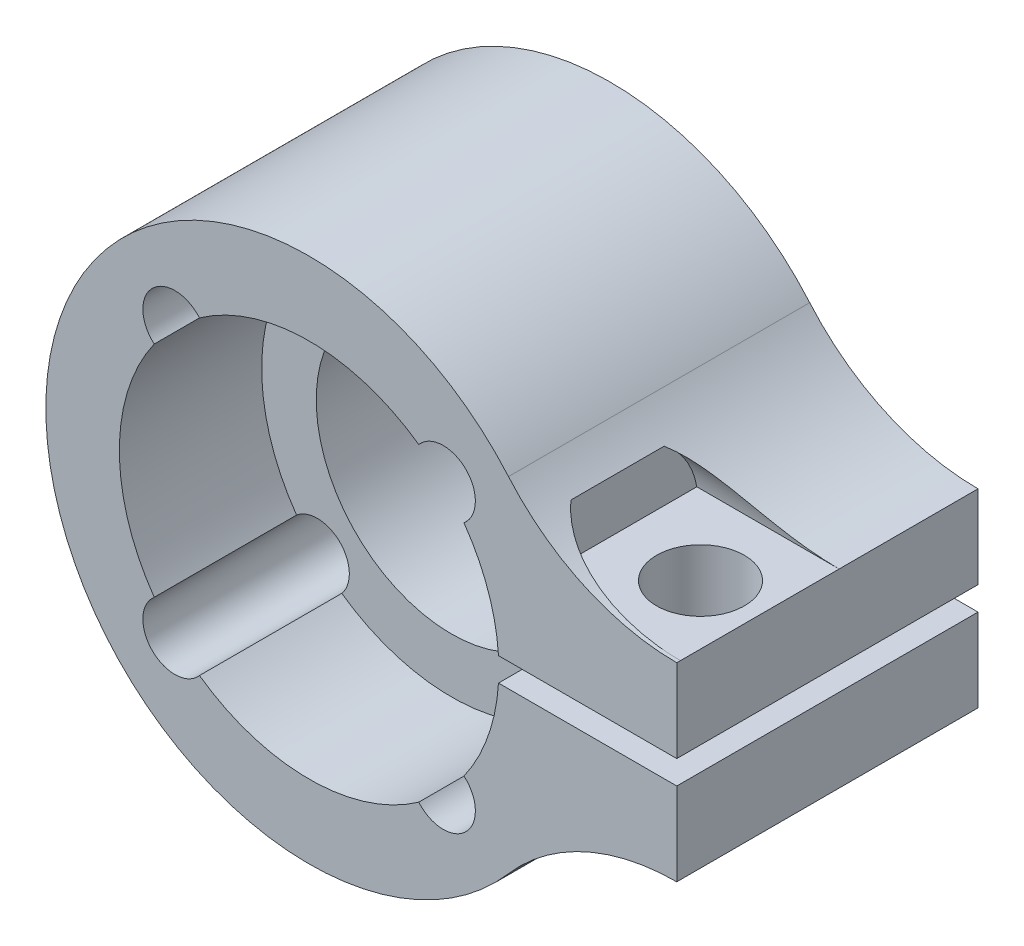
ISO-10303-21;
HEADER;
FILE_DESCRIPTION(('STEP AP214'),'2;1');
FILE_NAME('part.step','',(''),(''),'','','');
FILE_SCHEMA(('AUTOMOTIVE_DESIGN { 1 0 10303 214 1 1 1 1 }'));
ENDSEC;
DATA;
#1=APPLICATION_CONTEXT('core data for automotive mechanical design processes');
#2=APPLICATION_PROTOCOL_DEFINITION('international standard','automotive_design',2000,#1);
#3=PRODUCT_CONTEXT('',#1,'mechanical');
#4=PRODUCT('Part','Part','',(#3));
#5=PRODUCT_RELATED_PRODUCT_CATEGORY('part','',(#4));
#6=PRODUCT_DEFINITION_FORMATION('','',#4);
#7=PRODUCT_DEFINITION_CONTEXT('part definition',#1,'design');
#8=PRODUCT_DEFINITION('design','',#6,#7);
#9=PRODUCT_DEFINITION_SHAPE('','',#8);
#10=(LENGTH_UNIT() NAMED_UNIT(*) SI_UNIT(.MILLI.,.METRE.));
#11=(NAMED_UNIT(*) PLANE_ANGLE_UNIT() SI_UNIT($,.RADIAN.));
#12=(NAMED_UNIT(*) SI_UNIT($,.STERADIAN.) SOLID_ANGLE_UNIT());
#13=UNCERTAINTY_MEASURE_WITH_UNIT(LENGTH_MEASURE(1.E-05),#10,'distance_accuracy_value','');
#14=(GEOMETRIC_REPRESENTATION_CONTEXT(3) GLOBAL_UNCERTAINTY_ASSIGNED_CONTEXT((#13)) GLOBAL_UNIT_ASSIGNED_CONTEXT((#10,
#11,#12)) REPRESENTATION_CONTEXT('',''));
#15=CARTESIAN_POINT('',(0.,0.,0.));
#16=DIRECTION('',(0.,0.,1.));
#17=DIRECTION('',(1.,0.,0.));
#18=AXIS2_PLACEMENT_3D('',#15,#16,#17);
#19=CARTESIAN_POINT('',(15.5,4.,-0.153359893863698));
#20=DIRECTION('',(0.,-1.,0.));
#21=DIRECTION('',(0.,0.,-1.));
#22=AXIS2_PLACEMENT_3D('',#19,#20,#21);
#23=PLANE('',#22);
#24=CARTESIAN_POINT('',(13.,4.,-3.5));
#25=DIRECTION('',(0.,-1.,0.));
#26=DIRECTION('',(0.,0.,-1.));
#27=AXIS2_PLACEMENT_3D('',#24,#25,#26);
#28=CIRCLE('',#27,1.85);
#29=CARTESIAN_POINT('',(13.,4.,-5.35));
#30=VERTEX_POINT('',#29);
#31=EDGE_CURVE('E21',#30,#30,#28,.T.);
#32=ORIENTED_EDGE('',*,*,#31,.T.);
#33=EDGE_LOOP('',(#32));
#34=FACE_BOUND('',#33,.T.);
#35=DIRECTION('',(1.,0.,0.));
#36=VECTOR('',#35,1.);
#37=CARTESIAN_POINT('',(15.5,4.,-6.8466401061363));
#38=LINE('',#37,#36);
#39=CARTESIAN_POINT('',(15.5,4.00000000000002,-6.8466401061363));
#40=VERTEX_POINT('',#39);
#41=CARTESIAN_POINT('',(9.5,4.,-6.8466401061363));
#42=VERTEX_POINT('',#41);
#43=EDGE_CURVE('E349',#40,#42,#38,.F.);
#44=ORIENTED_EDGE('',*,*,#43,.T.);
#45=DIRECTION('',(0.,0.,-1.));
#46=VECTOR('',#45,1.);
#47=CARTESIAN_POINT('',(9.5,4.,0.));
#48=LINE('',#47,#46);
#49=CARTESIAN_POINT('',(9.5,4.,-0.153359893863698));
#50=VERTEX_POINT('',#49);
#51=EDGE_CURVE('E344',#50,#42,#48,.T.);
#52=ORIENTED_EDGE('',*,*,#51,.F.);
#53=DIRECTION('',(1.,0.,0.));
#54=VECTOR('',#53,1.);
#55=CARTESIAN_POINT('',(15.5,4.,-0.153359893863698));
#56=LINE('',#55,#54);
#57=CARTESIAN_POINT('',(15.5,4.00000000000002,-0.153359893863703));
#58=VERTEX_POINT('',#57);
#59=EDGE_CURVE('E351',#50,#58,#56,.T.);
#60=ORIENTED_EDGE('',*,*,#59,.T.);
#61=DIRECTION('',(0.,0.,-1.));
#62=VECTOR('',#61,1.);
#63=CARTESIAN_POINT('',(15.5,4.,0.));
#64=LINE('',#63,#62);
#65=EDGE_CURVE('E181',#40,#58,#64,.F.);
#66=ORIENTED_EDGE('',*,*,#65,.F.);
#67=EDGE_LOOP('',(#44,#52,#60,#66));
#68=FACE_BOUND('',#67,.T.);
#69=ADVANCED_FACE('F18',(#34,#68),#23,.F.);
#70=CARTESIAN_POINT('',(13.,4.,-3.5));
#71=DIRECTION('',(0.,-1.,0.));
#72=DIRECTION('',(0.,0.,-1.));
#73=AXIS2_PLACEMENT_3D('',#70,#71,#72);
#74=CYLINDRICAL_SURFACE('',#73,1.85);
#75=ORIENTED_EDGE('',*,*,#31,.F.);
#76=EDGE_LOOP('',(#75));
#77=FACE_BOUND('',#76,.T.);
#78=CARTESIAN_POINT('',(13.,0.5,-3.5));
#79=DIRECTION('',(0.,-1.,0.));
#80=DIRECTION('',(0.,0.,-1.));
#81=AXIS2_PLACEMENT_3D('',#78,#79,#80);
#82=CIRCLE('',#81,1.85);
#83=CARTESIAN_POINT('',(13.,0.5,-5.35));
#84=VERTEX_POINT('',#83);
#85=EDGE_CURVE('E189',#84,#84,#82,.T.);
#86=ORIENTED_EDGE('',*,*,#85,.T.);
#87=EDGE_LOOP('',(#86));
#88=FACE_BOUND('',#87,.T.);
#89=ADVANCED_FACE('F276',(#77,#88),#74,.F.);
#90=CARTESIAN_POINT('',(0.,0.,-6.));
#91=DIRECTION('',(0.,0.,-1.));
#92=DIRECTION('',(-1.,0.,0.));
#93=AXIS2_PLACEMENT_3D('',#90,#91,#92);
#94=PLANE('',#93);
#95=CARTESIAN_POINT('',(0.,0.,-6.));
#96=DIRECTION('',(0.,0.,-1.));
#97=DIRECTION('',(-1.,0.,0.));
#98=AXIS2_PLACEMENT_3D('',#95,#96,#97);
#99=CIRCLE('',#98,8.);
#100=CARTESIAN_POINT('',(7.98435971133566,0.5,-6.));
#101=VERTEX_POINT('',#100);
#102=CARTESIAN_POINT('',(6.52895071917872,4.62307284244318,-6.));
#103=VERTEX_POINT('',#102);
#104=EDGE_CURVE('E355',#101,#103,#99,.F.);
#105=ORIENTED_EDGE('',*,*,#104,.T.);
#106=CARTESIAN_POINT('',(5.65685424949238,5.65685424949238,-6.));
#107=DIRECTION('',(0.,0.,1.));
#108=DIRECTION('',(1.,0.,0.));
#109=AXIS2_PLACEMENT_3D('',#106,#107,#108);
#110=CIRCLE('',#109,1.3525);
#111=CARTESIAN_POINT('',(4.62307284244318,6.52895071917872,-6.));
#112=VERTEX_POINT('',#111);
#113=EDGE_CURVE('E361',#103,#112,#110,.F.);
#114=ORIENTED_EDGE('',*,*,#113,.T.);
#115=CARTESIAN_POINT('',(0.,0.,-6.));
#116=DIRECTION('',(0.,0.,-1.));
#117=DIRECTION('',(-1.,0.,0.));
#118=AXIS2_PLACEMENT_3D('',#115,#116,#117);
#119=CIRCLE('',#118,8.);
#120=CARTESIAN_POINT('',(-4.62307284244318,6.52895071917872,-6.));
#121=VERTEX_POINT('',#120);
#122=EDGE_CURVE('E384',#112,#121,#119,.F.);
#123=ORIENTED_EDGE('',*,*,#122,.T.);
#124=CARTESIAN_POINT('',(-5.65685424949238,5.65685424949238,-6.));
#125=DIRECTION('',(0.,0.,1.));
#126=DIRECTION('',(1.,0.,0.));
#127=AXIS2_PLACEMENT_3D('',#124,#125,#126);
#128=CIRCLE('',#127,1.3525);
#129=CARTESIAN_POINT('',(-6.52895071917872,4.62307284244318,-6.));
#130=VERTEX_POINT('',#129);
#131=EDGE_CURVE('E364',#121,#130,#128,.F.);
#132=ORIENTED_EDGE('',*,*,#131,.T.);
#133=CARTESIAN_POINT('',(0.,0.,-6.));
#134=DIRECTION('',(0.,0.,-1.));
#135=DIRECTION('',(-1.,0.,0.));
#136=AXIS2_PLACEMENT_3D('',#133,#134,#135);
#137=CIRCLE('',#136,8.);
#138=CARTESIAN_POINT('',(-6.52895071917873,-4.62307284244317,-6.));
#139=VERTEX_POINT('',#138);
#140=EDGE_CURVE('E386',#130,#139,#137,.F.);
#141=ORIENTED_EDGE('',*,*,#140,.T.);
#142=CARTESIAN_POINT('',(-5.65685424949238,-5.65685424949235,-6.));
#143=DIRECTION('',(0.,0.,1.));
#144=DIRECTION('',(1.,0.,0.));
#145=AXIS2_PLACEMENT_3D('',#142,#143,#144);
#146=CIRCLE('',#145,1.3525);
#147=CARTESIAN_POINT('',(-4.6230728424432,-6.52895071917871,-6.));
#148=VERTEX_POINT('',#147);
#149=EDGE_CURVE('E174',#139,#148,#146,.F.);
#150=ORIENTED_EDGE('',*,*,#149,.T.);
#151=CARTESIAN_POINT('',(0.,0.,-6.));
#152=DIRECTION('',(0.,0.,-1.));
#153=DIRECTION('',(-1.,0.,0.));
#154=AXIS2_PLACEMENT_3D('',#151,#152,#153);
#155=CIRCLE('',#154,8.);
#156=CARTESIAN_POINT('',(4.62307284244319,-6.52895071917871,-6.));
#157=VERTEX_POINT('',#156);
#158=EDGE_CURVE('E157',#148,#157,#155,.F.);
#159=ORIENTED_EDGE('',*,*,#158,.T.);
#160=CARTESIAN_POINT('',(5.65685424949238,-5.65685424949236,-6.));
#161=DIRECTION('',(0.,0.,1.));
#162=DIRECTION('',(1.,0.,0.));
#163=AXIS2_PLACEMENT_3D('',#160,#161,#162);
#164=CIRCLE('',#163,1.3525);
#165=CARTESIAN_POINT('',(6.52895071917873,-4.62307284244317,-6.));
#166=VERTEX_POINT('',#165);
#167=EDGE_CURVE('E159',#157,#166,#164,.F.);
#168=ORIENTED_EDGE('',*,*,#167,.T.);
#169=CARTESIAN_POINT('',(0.,0.,-6.));
#170=DIRECTION('',(0.,0.,-1.));
#171=DIRECTION('',(-1.,0.,0.));
#172=AXIS2_PLACEMENT_3D('',#169,#170,#171);
#173=CIRCLE('',#172,8.);
#174=CARTESIAN_POINT('',(7.98435971133566,-0.5,-6.));
#175=VERTEX_POINT('',#174);
#176=EDGE_CURVE('E147',#166,#175,#173,.F.);
#177=ORIENTED_EDGE('',*,*,#176,.T.);
#178=DIRECTION('',(1.,0.,0.));
#179=VECTOR('',#178,1.);
#180=CARTESIAN_POINT('',(0.,-0.5,-6.));
#181=LINE('',#180,#179);
#182=CARTESIAN_POINT('',(5.67802782663136,-0.499999999999999,-6.));
#183=VERTEX_POINT('',#182);
#184=EDGE_CURVE('E180',#175,#183,#181,.F.);
#185=ORIENTED_EDGE('',*,*,#184,.T.);
#186=CARTESIAN_POINT('',(0.,0.,-6.));
#187=DIRECTION('',(0.,0.,-1.));
#188=DIRECTION('',(-1.,0.,0.));
#189=AXIS2_PLACEMENT_3D('',#186,#187,#188);
#190=CIRCLE('',#189,5.7);
#191=CARTESIAN_POINT('',(5.67802782663136,0.5,-6.));
#192=VERTEX_POINT('',#191);
#193=EDGE_CURVE('E185',#183,#192,#190,.T.);
#194=ORIENTED_EDGE('',*,*,#193,.T.);
#195=DIRECTION('',(1.,0.,0.));
#196=VECTOR('',#195,1.);
#197=CARTESIAN_POINT('',(15.5,0.5,-6.));
#198=LINE('',#197,#196);
#199=EDGE_CURVE('E186',#192,#101,#198,.T.);
#200=ORIENTED_EDGE('',*,*,#199,.T.);
#201=EDGE_LOOP('',(#105,#114,#123,#132,#141,#150,#159,#168,#177,#185,#194,#200));
#202=FACE_BOUND('',#201,.T.);
#203=ADVANCED_FACE('F160',(#202),#94,.F.);
#204=CARTESIAN_POINT('',(0.,0.,0.));
#205=DIRECTION('',(0.,0.,-1.));
#206=DIRECTION('',(-1.,0.,0.));
#207=AXIS2_PLACEMENT_3D('',#204,#205,#206);
#208=CYLINDRICAL_SURFACE('',#207,8.);
#209=ORIENTED_EDGE('',*,*,#176,.F.);
#210=DIRECTION('',(0.,0.,1.));
#211=VECTOR('',#210,1.);
#212=CARTESIAN_POINT('',(6.52895071917873,-4.62307284244317,0.));
#213=LINE('',#212,#211);
#214=CARTESIAN_POINT('',(6.52895071917873,-4.62307284244317,0.));
#215=VERTEX_POINT('',#214);
#216=EDGE_CURVE('E152',#166,#215,#213,.T.);
#217=ORIENTED_EDGE('',*,*,#216,.T.);
#218=CARTESIAN_POINT('',(0.,0.,0.));
#219=DIRECTION('',(0.,0.,-1.));
#220=DIRECTION('',(-1.,0.,0.));
#221=AXIS2_PLACEMENT_3D('',#218,#219,#220);
#222=CIRCLE('',#221,8.);
#223=CARTESIAN_POINT('',(7.98435971133566,-0.5,0.));
#224=VERTEX_POINT('',#223);
#225=EDGE_CURVE('E404',#224,#215,#222,.T.);
#226=ORIENTED_EDGE('',*,*,#225,.F.);
#227=DIRECTION('',(0.,0.,-1.));
#228=VECTOR('',#227,1.);
#229=CARTESIAN_POINT('',(7.98435971133566,-0.5,0.));
#230=LINE('',#229,#228);
#231=EDGE_CURVE('E154',#224,#175,#230,.T.);
#232=ORIENTED_EDGE('',*,*,#231,.T.);
#233=EDGE_LOOP('',(#209,#217,#226,#232));
#234=FACE_BOUND('',#233,.T.);
#235=ADVANCED_FACE('F149',(#234),#208,.F.);
#236=CARTESIAN_POINT('',(0.,0.,0.));
#237=DIRECTION('',(0.,0.,-1.));
#238=DIRECTION('',(-1.,0.,0.));
#239=AXIS2_PLACEMENT_3D('',#236,#237,#238);
#240=CYLINDRICAL_SURFACE('',#239,8.);
#241=CARTESIAN_POINT('',(0.,0.,0.));
#242=DIRECTION('',(0.,0.,-1.));
#243=DIRECTION('',(-1.,0.,0.));
#244=AXIS2_PLACEMENT_3D('',#241,#242,#243);
#245=CIRCLE('',#244,8.);
#246=CARTESIAN_POINT('',(4.62307284244319,-6.52895071917871,0.));
#247=VERTEX_POINT('',#246);
#248=CARTESIAN_POINT('',(-4.6230728424432,-6.52895071917871,0.));
#249=VERTEX_POINT('',#248);
#250=EDGE_CURVE('E408',#247,#249,#245,.T.);
#251=ORIENTED_EDGE('',*,*,#250,.F.);
#252=DIRECTION('',(0.,0.,1.));
#253=VECTOR('',#252,1.);
#254=CARTESIAN_POINT('',(4.62307284244319,-6.52895071917871,0.));
#255=LINE('',#254,#253);
#256=EDGE_CURVE('E165',#247,#157,#255,.F.);
#257=ORIENTED_EDGE('',*,*,#256,.T.);
#258=ORIENTED_EDGE('',*,*,#158,.F.);
#259=DIRECTION('',(0.,0.,1.));
#260=VECTOR('',#259,1.);
#261=CARTESIAN_POINT('',(-4.6230728424432,-6.52895071917871,0.));
#262=LINE('',#261,#260);
#263=EDGE_CURVE('E171',#148,#249,#262,.T.);
#264=ORIENTED_EDGE('',*,*,#263,.T.);
#265=EDGE_LOOP('',(#251,#257,#258,#264));
#266=FACE_BOUND('',#265,.T.);
#267=ADVANCED_FACE('F268',(#266),#240,.F.);
#268=CARTESIAN_POINT('',(0.,0.,0.));
#269=DIRECTION('',(0.,0.,-1.));
#270=DIRECTION('',(-1.,0.,0.));
#271=AXIS2_PLACEMENT_3D('',#268,#269,#270);
#272=CYLINDRICAL_SURFACE('',#271,8.);
#273=DIRECTION('',(0.,0.,1.));
#274=VECTOR('',#273,1.);
#275=CARTESIAN_POINT('',(-6.52895071917872,4.62307284244318,0.));
#276=LINE('',#275,#274);
#277=CARTESIAN_POINT('',(-6.52895071917872,4.62307284244318,0.));
#278=VERTEX_POINT('',#277);
#279=EDGE_CURVE('E362',#130,#278,#276,.T.);
#280=ORIENTED_EDGE('',*,*,#279,.T.);
#281=CARTESIAN_POINT('',(0.,0.,0.));
#282=DIRECTION('',(0.,0.,-1.));
#283=DIRECTION('',(-1.,0.,0.));
#284=AXIS2_PLACEMENT_3D('',#281,#282,#283);
#285=CIRCLE('',#284,8.);
#286=CARTESIAN_POINT('',(-6.52895071917873,-4.62307284244317,0.));
#287=VERTEX_POINT('',#286);
#288=EDGE_CURVE('E394',#287,#278,#285,.T.);
#289=ORIENTED_EDGE('',*,*,#288,.F.);
#290=DIRECTION('',(0.,0.,1.));
#291=VECTOR('',#290,1.);
#292=CARTESIAN_POINT('',(-6.52895071917874,-4.62307284244316,0.));
#293=LINE('',#292,#291);
#294=EDGE_CURVE('E177',#287,#139,#293,.F.);
#295=ORIENTED_EDGE('',*,*,#294,.T.);
#296=ORIENTED_EDGE('',*,*,#140,.F.);
#297=EDGE_LOOP('',(#280,#289,#295,#296));
#298=FACE_BOUND('',#297,.T.);
#299=ADVANCED_FACE('F264',(#298),#272,.F.);
#300=CARTESIAN_POINT('',(0.,0.,0.));
#301=DIRECTION('',(0.,0.,-1.));
#302=DIRECTION('',(-1.,0.,0.));
#303=AXIS2_PLACEMENT_3D('',#300,#301,#302);
#304=CYLINDRICAL_SURFACE('',#303,8.);
#305=CARTESIAN_POINT('',(0.,0.,0.));
#306=DIRECTION('',(0.,0.,-1.));
#307=DIRECTION('',(-1.,0.,0.));
#308=AXIS2_PLACEMENT_3D('',#305,#306,#307);
#309=CIRCLE('',#308,8.);
#310=CARTESIAN_POINT('',(-4.62307284244318,6.52895071917872,0.));
#311=VERTEX_POINT('',#310);
#312=CARTESIAN_POINT('',(4.62307284244318,6.52895071917872,0.));
#313=VERTEX_POINT('',#312);
#314=EDGE_CURVE('E417',#311,#313,#309,.T.);
#315=ORIENTED_EDGE('',*,*,#314,.F.);
#316=DIRECTION('',(0.,0.,1.));
#317=VECTOR('',#316,1.);
#318=CARTESIAN_POINT('',(-4.62307284244318,6.52895071917872,0.));
#319=LINE('',#318,#317);
#320=EDGE_CURVE('E365',#311,#121,#319,.F.);
#321=ORIENTED_EDGE('',*,*,#320,.T.);
#322=ORIENTED_EDGE('',*,*,#122,.F.);
#323=DIRECTION('',(0.,0.,1.));
#324=VECTOR('',#323,1.);
#325=CARTESIAN_POINT('',(4.62307284244318,6.52895071917872,0.));
#326=LINE('',#325,#324);
#327=EDGE_CURVE('E356',#112,#313,#326,.T.);
#328=ORIENTED_EDGE('',*,*,#327,.T.);
#329=EDGE_LOOP('',(#315,#321,#322,#328));
#330=FACE_BOUND('',#329,.T.);
#331=ADVANCED_FACE('F260',(#330),#304,.F.);
#332=CARTESIAN_POINT('',(0.,0.,0.));
#333=DIRECTION('',(0.,0.,-1.));
#334=DIRECTION('',(-1.,0.,0.));
#335=AXIS2_PLACEMENT_3D('',#332,#333,#334);
#336=CYLINDRICAL_SURFACE('',#335,8.);
#337=CARTESIAN_POINT('',(0.,0.,0.));
#338=DIRECTION('',(0.,0.,-1.));
#339=DIRECTION('',(-1.,0.,0.));
#340=AXIS2_PLACEMENT_3D('',#337,#338,#339);
#341=CIRCLE('',#340,8.);
#342=CARTESIAN_POINT('',(6.52895071917872,4.62307284244318,0.));
#343=VERTEX_POINT('',#342);
#344=CARTESIAN_POINT('',(7.98435971133566,0.5,0.));
#345=VERTEX_POINT('',#344);
#346=EDGE_CURVE('E246',#343,#345,#341,.T.);
#347=ORIENTED_EDGE('',*,*,#346,.F.);
#348=DIRECTION('',(0.,0.,1.));
#349=VECTOR('',#348,1.);
#350=CARTESIAN_POINT('',(6.52895071917872,4.62307284244318,0.));
#351=LINE('',#350,#349);
#352=EDGE_CURVE('E358',#343,#103,#351,.F.);
#353=ORIENTED_EDGE('',*,*,#352,.T.);
#354=ORIENTED_EDGE('',*,*,#104,.F.);
#355=DIRECTION('',(0.,0.,1.));
#356=VECTOR('',#355,1.);
#357=CARTESIAN_POINT('',(7.98435971133566,0.5,0.));
#358=LINE('',#357,#356);
#359=EDGE_CURVE('E182',#101,#345,#358,.T.);
#360=ORIENTED_EDGE('',*,*,#359,.T.);
#361=EDGE_LOOP('',(#347,#353,#354,#360));
#362=FACE_BOUND('',#361,.T.);
#363=ADVANCED_FACE('F254',(#362),#336,.F.);
#364=CARTESIAN_POINT('',(15.5,3.4,-3.5));
#365=DIRECTION('',(1.,0.,0.));
#366=DIRECTION('',(0.,0.,-1.));
#367=AXIS2_PLACEMENT_3D('',#364,#365,#366);
#368=CYLINDRICAL_SURFACE('',#367,3.4);
#369=ORIENTED_EDGE('',*,*,#59,.F.);
#370=CARTESIAN_POINT('',(9.5,3.4,-3.5));
#371=DIRECTION('',(1.,0.,0.));
#372=DIRECTION('',(0.,0.,-1.));
#373=AXIS2_PLACEMENT_3D('',#370,#371,#372);
#374=CIRCLE('',#373,3.4);
#375=CARTESIAN_POINT('',(9.50000000000001,6.17329140254585,-1.53305953405669));
#376=VERTEX_POINT('',#375);
#377=EDGE_CURVE('E348',#376,#50,#374,.T.);
#378=ORIENTED_EDGE('',*,*,#377,.F.);
#379=CARTESIAN_POINT('',(9.50000000000004,6.17329140254583,-1.53305953405666));
#380=CARTESIAN_POINT('',(9.5662266636751,6.11803701373512,-1.45516119273622));
#381=CARTESIAN_POINT('',(9.63634146561116,6.06115417885218,-1.3819033724065));
#382=CARTESIAN_POINT('',(9.7832781028024,5.94566598238027,-1.24442267295331));
#383=CARTESIAN_POINT('',(9.860084194737,5.88706486833967,-1.18017946753184));
#384=CARTESIAN_POINT('',(10.01856117319,5.77020829173327,-1.06094475951218));
#385=CARTESIAN_POINT('',(10.1001517025145,5.7119589653624,-1.0058393270431));
#386=CARTESIAN_POINT('',(10.2684068362733,5.59602862932098,-0.903183570747615));
#387=CARTESIAN_POINT('',(10.3550749385378,5.53834804417483,-0.855638540890702));
#388=CARTESIAN_POINT('',(10.5668799136074,5.40258133782908,-0.750524754239663));
#389=CARTESIAN_POINT('',(10.6940132020045,5.32516131815501,-0.696113782066301));
#390=CARTESIAN_POINT('',(10.9550633284026,5.17482725411204,-0.598618076457856));
#391=CARTESIAN_POINT('',(11.0889818273237,5.10191432280391,-0.555536132334579));
#392=CARTESIAN_POINT('',(11.3632757999144,4.9612884782937,-0.478602003828329));
#393=CARTESIAN_POINT('',(11.5036886833969,4.89361389012481,-0.444813929045058));
#394=CARTESIAN_POINT('',(11.789134119524,4.76480306162026,-0.385141295826796));
#395=CARTESIAN_POINT('',(11.9341681798831,4.7036689841494,-0.359259346631436));
#396=CARTESIAN_POINT('',(12.2986134627044,4.56083144938517,-0.302984980849141));
#397=CARTESIAN_POINT('',(12.5202810259395,4.48335693299546,-0.276399783243157));
#398=CARTESIAN_POINT('',(12.969751171012,4.34506614412726,-0.233184220397538));
#399=CARTESIAN_POINT('',(13.1975570155677,4.28425893072076,-0.216559262985755));
#400=CARTESIAN_POINT('',(13.6570039926272,4.18004396309459,-0.190255171511912));
#401=CARTESIAN_POINT('',(13.8886365279866,4.13660159772975,-0.180562190066232));
#402=CARTESIAN_POINT('',(14.35454103967,4.06730588084745,-0.165939197459917));
#403=CARTESIAN_POINT('',(14.5888113881984,4.0414422277984,-0.161006396010977));
#404=CARTESIAN_POINT('',(14.9363093135263,4.01629057264591,-0.1563131759538));
#405=CARTESIAN_POINT('',(15.0490640724916,4.0101769515099,-0.155196925767495));
#406=CARTESIAN_POINT('',(15.2745423088303,4.00203504356611,-0.153723780945178));
#407=CARTESIAN_POINT('',(15.3872655386453,4.0000001263796,-0.153365653843975));
#408=CARTESIAN_POINT('',(15.5,4.00000000000005,-0.153359893863707));
#409=B_SPLINE_CURVE_WITH_KNOTS('',3,(#379,#380,#381,#382,#383,#384,#385,#386,#387,#388,#389,
#390,#391,#392,#393,#394,#395,#396,#397,#398,#399,#400,#401,#402,#403,#404,#405,#406,#407,#408),
.UNSPECIFIED.,.F.,.F.,(4,2,2,2,2,2,2,2,2,2,2,2,2,2,4),(0.,0.348320084948595,0.695841697919725,
1.03863752006756,1.38167232875745,1.85638193496898,2.33120830988997,2.8092322997522,
3.28741388070164,3.99533511768047,4.70364036698009,5.41052671623477,6.11699845575183,
6.45571140375598,6.7938732888446),.UNSPECIFIED.);
#410=EDGE_CURVE('E238',#376,#58,#409,.T.);
#411=ORIENTED_EDGE('',*,*,#410,.T.);
#412=EDGE_LOOP('',(#369,#378,#411));
#413=FACE_BOUND('',#412,.T.);
#414=ADVANCED_FACE('F249',(#413),#368,.F.);
#415=CARTESIAN_POINT('',(15.5,3.4,-3.5));
#416=DIRECTION('',(1.,0.,0.));
#417=DIRECTION('',(0.,0.,-1.));
#418=AXIS2_PLACEMENT_3D('',#415,#416,#417);
#419=CYLINDRICAL_SURFACE('',#418,3.4);
#420=CARTESIAN_POINT('',(9.5,3.4,-3.5));
#421=DIRECTION('',(1.,0.,0.));
#422=DIRECTION('',(0.,0.,-1.));
#423=AXIS2_PLACEMENT_3D('',#420,#421,#422);
#424=CIRCLE('',#423,3.4);
#425=CARTESIAN_POINT('',(9.50000000000002,6.17329140254583,-5.46694046594333));
#426=VERTEX_POINT('',#425);
#427=EDGE_CURVE('E347',#42,#426,#424,.T.);
#428=ORIENTED_EDGE('',*,*,#427,.F.);
#429=ORIENTED_EDGE('',*,*,#43,.F.);
#430=CARTESIAN_POINT('',(15.5,4.00000000000005,-6.84664010613629));
#431=CARTESIAN_POINT('',(15.3721209354606,3.99999836614938,-6.84662699427895));
#432=CARTESIAN_POINT('',(15.2442424329338,4.00261816108712,-6.84617035562875));
#433=CARTESIAN_POINT('',(14.9887027067511,4.01308839698559,-6.84427488862196));
#434=CARTESIAN_POINT('',(14.8610414907553,4.02093901867666,-6.84283602632851));
#435=CARTESIAN_POINT('',(14.6060004214515,4.041871904222,-6.83887846633402));
#436=CARTESIAN_POINT('',(14.4786211270598,4.05496076237587,-6.83635840724918));
#437=CARTESIAN_POINT('',(14.2245465948605,4.08634024433909,-6.83004329153261));
#438=CARTESIAN_POINT('',(14.0978513483146,4.10463080153881,-6.82624825122738));
#439=CARTESIAN_POINT('',(13.7169461526605,4.16761589278201,-6.81250253149485));
#440=CARTESIAN_POINT('',(13.464079174232,4.22024671676137,-6.80021656649173));
#441=CARTESIAN_POINT('',(12.9642784207183,4.34599602845497,-6.766394930674));
#442=CARTESIAN_POINT('',(12.7173402806896,4.41909890860318,-6.7448662996802));
#443=CARTESIAN_POINT('',(12.3231417054624,4.55359435234665,-6.69877626146278));
#444=CARTESIAN_POINT('',(12.173342404943,4.60904051046879,-6.67840524745652));
#445=CARTESIAN_POINT('',(11.8776571631958,4.72711728030774,-6.63094524687409));
#446=CARTESIAN_POINT('',(11.7317712266421,4.78974790060503,-6.60385625227451));
#447=CARTESIAN_POINT('',(11.4451744942026,4.92143318619291,-6.5414691841544));
#448=CARTESIAN_POINT('',(11.304451461278,4.99047107957005,-6.50619219931265));
#449=CARTESIAN_POINT('',(11.0288960868217,5.13422404140032,-6.42562053835276));
#450=CARTESIAN_POINT('',(10.894061585861,5.20893700070039,-6.38032957211417));
#451=CARTESIAN_POINT('',(10.6682267665243,5.3412845955722,-6.29210449850068));
#452=CARTESIAN_POINT('',(10.5754894482143,5.39787063710789,-6.25203619375726));
#453=CARTESIAN_POINT('',(10.3943846790257,5.51264115544299,-6.16494569699808));
#454=CARTESIAN_POINT('',(10.3060158651095,5.57082512473837,-6.1179256925227));
#455=CARTESIAN_POINT('',(10.1345945037201,5.68776538084601,-6.01636790700626));
#456=CARTESIAN_POINT('',(10.0515259596536,5.74651926238315,-5.96185448247533));
#457=CARTESIAN_POINT('',(9.89122528628699,5.86368851927859,-5.84458922485287));
#458=CARTESIAN_POINT('',(9.81398881962917,5.92210411576426,-5.78184361109728));
#459=CARTESIAN_POINT('',(9.69780275336705,6.0126689279787,-5.67635517403288));
#460=CARTESIAN_POINT('',(9.65660722876365,6.045365861816,-5.63653590341936));
#461=CARTESIAN_POINT('',(9.57652143882171,6.10998632758244,-5.55395367778145));
#462=CARTESIAN_POINT('',(9.53763353321792,6.14190904874683,-5.51118780296503));
#463=CARTESIAN_POINT('',(9.50000000000004,6.17329140254583,-5.46694046594334));
#464=B_SPLINE_CURVE_WITH_KNOTS('',3,(#430,#431,#432,#433,#434,#435,#436,#437,#438,#439,#440,
#441,#442,#443,#444,#445,#446,#447,#448,#449,#450,#451,#452,#453,#454,#455,#456,#457,#458,#459,
#460,#461,#462,#463),.UNSPECIFIED.,.F.,.F.,(4,2,2,2,2,2,2,2,2,2,2,2,2,2,2,2,4),(0.,
0.38360823544799,0.767229725635,1.15133567519486,1.53543670636031,2.31012694919665,
3.08422818104017,3.56700819759536,4.04978879074702,4.53133948592132,5.01271207904685,
5.35982642537372,5.70683177435355,6.05273477854162,6.39837794532241,6.59618069046999,
6.79418233842384),.UNSPECIFIED.);
#465=EDGE_CURVE('E230',#40,#426,#464,.T.);
#466=ORIENTED_EDGE('',*,*,#465,.T.);
#467=EDGE_LOOP('',(#428,#429,#466));
#468=FACE_BOUND('',#467,.T.);
#469=ADVANCED_FACE('F253',(#468),#419,.F.);
#470=CARTESIAN_POINT('',(9.5,0.,0.));
#471=DIRECTION('',(1.,0.,0.));
#472=DIRECTION('',(0.,0.,-1.));
#473=AXIS2_PLACEMENT_3D('',#470,#471,#472);
#474=PLANE('',#473);
#475=ORIENTED_EDGE('',*,*,#51,.T.);
#476=ORIENTED_EDGE('',*,*,#427,.T.);
#477=DIRECTION('',(0.,0.,1.));
#478=VECTOR('',#477,1.);
#479=CARTESIAN_POINT('',(9.50000000000002,6.17329140254584,0.));
#480=LINE('',#479,#478);
#481=EDGE_CURVE('E303',#426,#376,#480,.T.);
#482=ORIENTED_EDGE('',*,*,#481,.T.);
#483=ORIENTED_EDGE('',*,*,#377,.T.);
#484=EDGE_LOOP('',(#475,#476,#482,#483));
#485=FACE_BOUND('',#484,.T.);
#486=ADVANCED_FACE('F493',(#485),#474,.T.);
#487=CARTESIAN_POINT('',(15.5,-4.,0.));
#488=DIRECTION('',(1.,0.,0.));
#489=DIRECTION('',(0.,0.,-1.));
#490=AXIS2_PLACEMENT_3D('',#487,#488,#489);
#491=PLANE('',#490);
#492=DIRECTION('',(0.,0.,1.));
#493=VECTOR('',#492,1.);
#494=CARTESIAN_POINT('',(15.5,0.5,0.));
#495=LINE('',#494,#493);
#496=CARTESIAN_POINT('',(15.5,0.5,0.));
#497=VERTEX_POINT('',#496);
#498=CARTESIAN_POINT('',(15.5,0.5,-12.7));
#499=VERTEX_POINT('',#498);
#500=EDGE_CURVE('E184',#497,#499,#495,.F.);
#501=ORIENTED_EDGE('',*,*,#500,.T.);
#502=DIRECTION('',(0.,1.,0.));
#503=VECTOR('',#502,1.);
#504=CARTESIAN_POINT('',(15.5,0.,-12.7));
#505=LINE('',#504,#503);
#506=CARTESIAN_POINT('',(15.5,4.00000000000005,-12.7));
#507=VERTEX_POINT('',#506);
#508=EDGE_CURVE('E297',#499,#507,#505,.T.);
#509=ORIENTED_EDGE('',*,*,#508,.T.);
#510=DIRECTION('',(0.,0.,1.));
#511=VECTOR('',#510,1.);
#512=CARTESIAN_POINT('',(15.5,4.00000000000005,0.));
#513=LINE('',#512,#511);
#514=EDGE_CURVE('E451',#507,#40,#513,.T.);
#515=ORIENTED_EDGE('',*,*,#514,.T.);
#516=ORIENTED_EDGE('',*,*,#65,.T.);
#517=DIRECTION('',(0.,0.,1.));
#518=VECTOR('',#517,1.);
#519=CARTESIAN_POINT('',(15.5,4.00000000000005,0.));
#520=LINE('',#519,#518);
#521=CARTESIAN_POINT('',(15.5,4.00000000000005,0.));
#522=VERTEX_POINT('',#521);
#523=EDGE_CURVE('E245',#58,#522,#520,.T.);
#524=ORIENTED_EDGE('',*,*,#523,.T.);
#525=DIRECTION('',(0.,1.,0.));
#526=VECTOR('',#525,1.);
#527=CARTESIAN_POINT('',(15.5,0.,0.));
#528=LINE('',#527,#526);
#529=EDGE_CURVE('E436',#497,#522,#528,.T.);
#530=ORIENTED_EDGE('',*,*,#529,.F.);
#531=EDGE_LOOP('',(#501,#509,#515,#516,#524,#530));
#532=FACE_BOUND('',#531,.T.);
#533=ADVANCED_FACE('F497',(#532),#491,.T.);
#534=CARTESIAN_POINT('',(0.,-0.5,0.));
#535=DIRECTION('',(0.,-1.,0.));
#536=DIRECTION('',(0.,0.,-1.));
#537=AXIS2_PLACEMENT_3D('',#534,#535,#536);
#538=PLANE('',#537);
#539=CARTESIAN_POINT('',(13.,-0.5,-3.5));
#540=DIRECTION('',(0.,-1.,0.));
#541=DIRECTION('',(0.,0.,-1.));
#542=AXIS2_PLACEMENT_3D('',#539,#540,#541);
#543=CIRCLE('',#542,1.3525);
#544=CARTESIAN_POINT('',(13.,-0.5,-4.8525));
#545=VERTEX_POINT('',#544);
#546=EDGE_CURVE('E341',#545,#545,#543,.T.);
#547=ORIENTED_EDGE('',*,*,#546,.T.);
#548=EDGE_LOOP('',(#547));
#549=FACE_BOUND('',#548,.T.);
#550=ORIENTED_EDGE('',*,*,#231,.F.);
#551=DIRECTION('',(1.,0.,0.));
#552=VECTOR('',#551,1.);
#553=CARTESIAN_POINT('',(0.,-0.5,0.));
#554=LINE('',#553,#552);
#555=CARTESIAN_POINT('',(15.5,-0.5,0.));
#556=VERTEX_POINT('',#555);
#557=EDGE_CURVE('E406',#556,#224,#554,.F.);
#558=ORIENTED_EDGE('',*,*,#557,.F.);
#559=DIRECTION('',(0.,0.,-1.));
#560=VECTOR('',#559,1.);
#561=CARTESIAN_POINT('',(15.5,-0.5,0.));
#562=LINE('',#561,#560);
#563=CARTESIAN_POINT('',(15.5,-0.5,-12.7));
#564=VERTEX_POINT('',#563);
#565=EDGE_CURVE('E164',#564,#556,#562,.F.);
#566=ORIENTED_EDGE('',*,*,#565,.F.);
#567=DIRECTION('',(1.,0.,0.));
#568=VECTOR('',#567,1.);
#569=CARTESIAN_POINT('',(0.,-0.5,-12.7));
#570=LINE('',#569,#568);
#571=CARTESIAN_POINT('',(5.67802782663136,-0.499999999999999,-12.7));
#572=VERTEX_POINT('',#571);
#573=EDGE_CURVE('E301',#564,#572,#570,.F.);
#574=ORIENTED_EDGE('',*,*,#573,.T.);
#575=DIRECTION('',(0.,0.,-1.));
#576=VECTOR('',#575,1.);
#577=CARTESIAN_POINT('',(5.67802782663136,-0.499999999999998,0.));
#578=LINE('',#577,#576);
#579=EDGE_CURVE('E192',#572,#183,#578,.F.);
#580=ORIENTED_EDGE('',*,*,#579,.T.);
#581=ORIENTED_EDGE('',*,*,#184,.F.);
#582=EDGE_LOOP('',(#550,#558,#566,#574,#580,#581));
#583=FACE_BOUND('',#582,.T.);
#584=ADVANCED_FACE('F473',(#549,#583),#538,.F.);
#585=CARTESIAN_POINT('',(0.,0.,0.));
#586=DIRECTION('',(0.,0.,-1.));
#587=DIRECTION('',(-1.,0.,0.));
#588=AXIS2_PLACEMENT_3D('',#585,#586,#587);
#589=CYLINDRICAL_SURFACE('',#588,5.7);
#590=DIRECTION('',(0.,0.,1.));
#591=VECTOR('',#590,1.);
#592=CARTESIAN_POINT('',(5.67802782663136,0.5,0.));
#593=LINE('',#592,#591);
#594=CARTESIAN_POINT('',(5.67802782663136,0.5,-12.7));
#595=VERTEX_POINT('',#594);
#596=EDGE_CURVE('E190',#595,#192,#593,.T.);
#597=ORIENTED_EDGE('',*,*,#596,.T.);
#598=ORIENTED_EDGE('',*,*,#193,.F.);
#599=ORIENTED_EDGE('',*,*,#579,.F.);
#600=CARTESIAN_POINT('',(0.,0.,-12.7));
#601=DIRECTION('',(0.,0.,-1.));
#602=DIRECTION('',(-1.,0.,0.));
#603=AXIS2_PLACEMENT_3D('',#600,#601,#602);
#604=CIRCLE('',#603,5.7);
#605=EDGE_CURVE('E306',#572,#595,#604,.T.);
#606=ORIENTED_EDGE('',*,*,#605,.T.);
#607=EDGE_LOOP('',(#597,#598,#599,#606));
#608=FACE_BOUND('',#607,.T.);
#609=ADVANCED_FACE('F470',(#608),#589,.F.);
#610=CARTESIAN_POINT('',(15.5,0.5,0.));
#611=DIRECTION('',(0.,1.,0.));
#612=DIRECTION('',(0.,0.,1.));
#613=AXIS2_PLACEMENT_3D('',#610,#611,#612);
#614=PLANE('',#613);
#615=ORIENTED_EDGE('',*,*,#85,.F.);
#616=EDGE_LOOP('',(#615));
#617=FACE_BOUND('',#616,.T.);
#618=ORIENTED_EDGE('',*,*,#596,.F.);
#619=DIRECTION('',(1.,0.,0.));
#620=VECTOR('',#619,1.);
#621=CARTESIAN_POINT('',(0.,0.5,-12.7));
#622=LINE('',#621,#620);
#623=EDGE_CURVE('E308',#595,#499,#622,.T.);
#624=ORIENTED_EDGE('',*,*,#623,.T.);
#625=ORIENTED_EDGE('',*,*,#500,.F.);
#626=DIRECTION('',(1.,0.,0.));
#627=VECTOR('',#626,1.);
#628=CARTESIAN_POINT('',(0.,0.5,0.));
#629=LINE('',#628,#627);
#630=EDGE_CURVE('E403',#345,#497,#629,.T.);
#631=ORIENTED_EDGE('',*,*,#630,.F.);
#632=ORIENTED_EDGE('',*,*,#359,.F.);
#633=ORIENTED_EDGE('',*,*,#199,.F.);
#634=EDGE_LOOP('',(#618,#624,#625,#631,#632,#633));
#635=FACE_BOUND('',#634,.T.);
#636=ADVANCED_FACE('F433',(#617,#635),#614,.F.);
#637=CARTESIAN_POINT('',(5.65685424949238,5.65685424949238,0.));
#638=DIRECTION('',(0.,0.,1.));
#639=DIRECTION('',(1.,0.,0.));
#640=AXIS2_PLACEMENT_3D('',#637,#638,#639);
#641=CYLINDRICAL_SURFACE('',#640,1.3525);
#642=CARTESIAN_POINT('',(5.65685424949238,5.65685424949238,-12.7));
#643=DIRECTION('',(0.,0.,1.));
#644=DIRECTION('',(1.,0.,0.));
#645=AXIS2_PLACEMENT_3D('',#642,#643,#644);
#646=CIRCLE('',#645,1.3525);
#647=CARTESIAN_POINT('',(7.00935424949238,5.65685424949238,-12.7));
#648=VERTEX_POINT('',#647);
#649=EDGE_CURVE('E309',#648,#648,#646,.F.);
#650=ORIENTED_EDGE('',*,*,#649,.T.);
#651=EDGE_LOOP('',(#650));
#652=FACE_BOUND('',#651,.T.);
#653=ORIENTED_EDGE('',*,*,#352,.F.);
#654=CARTESIAN_POINT('',(5.65685424949238,5.65685424949238,0.));
#655=DIRECTION('',(0.,0.,1.));
#656=DIRECTION('',(1.,0.,0.));
#657=AXIS2_PLACEMENT_3D('',#654,#655,#656);
#658=CIRCLE('',#657,1.3525);
#659=EDGE_CURVE('E419',#313,#343,#658,.F.);
#660=ORIENTED_EDGE('',*,*,#659,.F.);
#661=ORIENTED_EDGE('',*,*,#327,.F.);
#662=ORIENTED_EDGE('',*,*,#113,.F.);
#663=EDGE_LOOP('',(#653,#660,#661,#662));
#664=FACE_BOUND('',#663,.T.);
#665=ADVANCED_FACE('F511',(#652,#664),#641,.F.);
#666=CARTESIAN_POINT('',(-5.65685424949238,5.65685424949238,0.));
#667=DIRECTION('',(0.,0.,1.));
#668=DIRECTION('',(1.,0.,0.));
#669=AXIS2_PLACEMENT_3D('',#666,#667,#668);
#670=CYLINDRICAL_SURFACE('',#669,1.3525);
#671=CARTESIAN_POINT('',(-5.65685424949238,5.65685424949238,-12.7));
#672=DIRECTION('',(0.,0.,1.));
#673=DIRECTION('',(1.,0.,0.));
#674=AXIS2_PLACEMENT_3D('',#671,#672,#673);
#675=CIRCLE('',#674,1.3525);
#676=CARTESIAN_POINT('',(-4.30435424949238,5.65685424949238,-12.7));
#677=VERTEX_POINT('',#676);
#678=EDGE_CURVE('E312',#677,#677,#675,.F.);
#679=ORIENTED_EDGE('',*,*,#678,.T.);
#680=EDGE_LOOP('',(#679));
#681=FACE_BOUND('',#680,.T.);
#682=ORIENTED_EDGE('',*,*,#279,.F.);
#683=ORIENTED_EDGE('',*,*,#131,.F.);
#684=ORIENTED_EDGE('',*,*,#320,.F.);
#685=CARTESIAN_POINT('',(-5.65685424949238,5.65685424949238,0.));
#686=DIRECTION('',(0.,0.,1.));
#687=DIRECTION('',(1.,0.,0.));
#688=AXIS2_PLACEMENT_3D('',#685,#686,#687);
#689=CIRCLE('',#688,1.3525);
#690=EDGE_CURVE('E414',#278,#311,#689,.F.);
#691=ORIENTED_EDGE('',*,*,#690,.F.);
#692=EDGE_LOOP('',(#682,#683,#684,#691));
#693=FACE_BOUND('',#692,.T.);
#694=ADVANCED_FACE('F515',(#681,#693),#670,.F.);
#695=CARTESIAN_POINT('',(-5.65685424949238,-5.65685424949235,0.));
#696=DIRECTION('',(0.,0.,1.));
#697=DIRECTION('',(1.,0.,0.));
#698=AXIS2_PLACEMENT_3D('',#695,#696,#697);
#699=CYLINDRICAL_SURFACE('',#698,1.3525);
#700=CARTESIAN_POINT('',(-5.65685424949238,-5.65685424949235,-12.7));
#701=DIRECTION('',(0.,0.,1.));
#702=DIRECTION('',(1.,0.,0.));
#703=AXIS2_PLACEMENT_3D('',#700,#701,#702);
#704=CIRCLE('',#703,1.3525);
#705=CARTESIAN_POINT('',(-4.30435424949238,-5.65685424949235,-12.7));
#706=VERTEX_POINT('',#705);
#707=EDGE_CURVE('E315',#706,#706,#704,.F.);
#708=ORIENTED_EDGE('',*,*,#707,.T.);
#709=EDGE_LOOP('',(#708));
#710=FACE_BOUND('',#709,.T.);
#711=ORIENTED_EDGE('',*,*,#263,.F.);
#712=ORIENTED_EDGE('',*,*,#149,.F.);
#713=ORIENTED_EDGE('',*,*,#294,.F.);
#714=CARTESIAN_POINT('',(-5.65685424949238,-5.65685424949235,0.));
#715=DIRECTION('',(0.,0.,1.));
#716=DIRECTION('',(1.,0.,0.));
#717=AXIS2_PLACEMENT_3D('',#714,#715,#716);
#718=CIRCLE('',#717,1.3525);
#719=EDGE_CURVE('E411',#249,#287,#718,.F.);
#720=ORIENTED_EDGE('',*,*,#719,.F.);
#721=EDGE_LOOP('',(#711,#712,#713,#720));
#722=FACE_BOUND('',#721,.T.);
#723=ADVANCED_FACE('F399',(#710,#722),#699,.F.);
#724=CARTESIAN_POINT('',(5.65685424949238,-5.65685424949236,0.));
#725=DIRECTION('',(0.,0.,1.));
#726=DIRECTION('',(1.,0.,0.));
#727=AXIS2_PLACEMENT_3D('',#724,#725,#726);
#728=CYLINDRICAL_SURFACE('',#727,1.3525);
#729=CARTESIAN_POINT('',(5.65685424949238,-5.65685424949236,-12.7));
#730=DIRECTION('',(0.,0.,1.));
#731=DIRECTION('',(1.,0.,0.));
#732=AXIS2_PLACEMENT_3D('',#729,#730,#731);
#733=CIRCLE('',#732,1.3525);
#734=CARTESIAN_POINT('',(7.00935424949238,-5.65685424949236,-12.7));
#735=VERTEX_POINT('',#734);
#736=EDGE_CURVE('E318',#735,#735,#733,.F.);
#737=ORIENTED_EDGE('',*,*,#736,.T.);
#738=EDGE_LOOP('',(#737));
#739=FACE_BOUND('',#738,.T.);
#740=ORIENTED_EDGE('',*,*,#256,.F.);
#741=CARTESIAN_POINT('',(5.65685424949238,-5.65685424949236,0.));
#742=DIRECTION('',(0.,0.,1.));
#743=DIRECTION('',(1.,0.,0.));
#744=AXIS2_PLACEMENT_3D('',#741,#742,#743);
#745=CIRCLE('',#744,1.3525);
#746=EDGE_CURVE('E169',#215,#247,#745,.F.);
#747=ORIENTED_EDGE('',*,*,#746,.F.);
#748=ORIENTED_EDGE('',*,*,#216,.F.);
#749=ORIENTED_EDGE('',*,*,#167,.F.);
#750=EDGE_LOOP('',(#740,#747,#748,#749));
#751=FACE_BOUND('',#750,.T.);
#752=ADVANCED_FACE('F167',(#739,#751),#728,.F.);
#753=CARTESIAN_POINT('',(15.5,-4.,0.));
#754=DIRECTION('',(1.,0.,0.));
#755=DIRECTION('',(0.,0.,-1.));
#756=AXIS2_PLACEMENT_3D('',#753,#754,#755);
#757=PLANE('',#756);
#758=DIRECTION('',(0.,0.,1.));
#759=VECTOR('',#758,1.);
#760=CARTESIAN_POINT('',(15.5,-4.00000000000005,0.));
#761=LINE('',#760,#759);
#762=CARTESIAN_POINT('',(15.5,-4.00000000000005,0.));
#763=VERTEX_POINT('',#762);
#764=CARTESIAN_POINT('',(15.5,-4.00000000000005,-12.7));
#765=VERTEX_POINT('',#764);
#766=EDGE_CURVE('E320',#763,#765,#761,.F.);
#767=ORIENTED_EDGE('',*,*,#766,.T.);
#768=DIRECTION('',(0.,1.,0.));
#769=VECTOR('',#768,1.);
#770=CARTESIAN_POINT('',(15.5,0.,-12.7));
#771=LINE('',#770,#769);
#772=EDGE_CURVE('E299',#765,#564,#771,.T.);
#773=ORIENTED_EDGE('',*,*,#772,.T.);
#774=ORIENTED_EDGE('',*,*,#565,.T.);
#775=DIRECTION('',(0.,1.,0.));
#776=VECTOR('',#775,1.);
#777=CARTESIAN_POINT('',(15.5,0.,0.));
#778=LINE('',#777,#776);
#779=EDGE_CURVE('E437',#763,#556,#778,.T.);
#780=ORIENTED_EDGE('',*,*,#779,.F.);
#781=EDGE_LOOP('',(#767,#773,#774,#780));
#782=FACE_BOUND('',#781,.T.);
#783=ADVANCED_FACE('F477',(#782),#757,.T.);
#784=CARTESIAN_POINT('',(13.,13.3211419426689,-3.5));
#785=DIRECTION('',(0.,-1.,0.));
#786=DIRECTION('',(0.,0.,-1.));
#787=AXIS2_PLACEMENT_3D('',#784,#785,#786);
#788=CYLINDRICAL_SURFACE('',#787,1.3525);
#789=ORIENTED_EDGE('',*,*,#546,.F.);
#790=EDGE_LOOP('',(#789));
#791=FACE_BOUND('',#790,.T.);
#792=CARTESIAN_POINT('',(14.3525,-4.0705373992811,-3.5));
#793=CARTESIAN_POINT('',(14.3524965476717,-4.07053701569379,-3.4246566949363));
#794=CARTESIAN_POINT('',(14.3461789904108,-4.07131070647417,-3.34922228543952));
#795=CARTESIAN_POINT('',(14.3210628269425,-4.07446265122429,-3.20039327574453));
#796=CARTESIAN_POINT('',(14.3022400177588,-4.0768440168728,-3.12700291921268));
#797=CARTESIAN_POINT('',(14.2526748104019,-4.08336786037683,-2.98449540371864));
#798=CARTESIAN_POINT('',(14.2219413194993,-4.08750902241106,-2.91537509612747));
#799=CARTESIAN_POINT('',(14.1494970838452,-4.09777370013448,-2.78335440966279));
#800=CARTESIAN_POINT('',(14.1077912124593,-4.10389633603229,-2.72045128645721));
#801=CARTESIAN_POINT('',(14.0146583719644,-4.1183708908711,-2.60257740741252));
#802=CARTESIAN_POINT('',(13.9632291064848,-4.12672333661795,-2.54760853082071));
#803=CARTESIAN_POINT('',(13.8522353164536,-4.14586595785134,-2.44711993416409));
#804=CARTESIAN_POINT('',(13.7926702576707,-4.15665629345073,-2.4016008351076));
#805=CARTESIAN_POINT('',(13.6669256324939,-4.18084909945127,-2.32098726363999));
#806=CARTESIAN_POINT('',(13.600715429921,-4.19426396700385,-2.28594434388355));
#807=CARTESIAN_POINT('',(13.4639208627694,-4.22364924180576,-2.22737623073849));
#808=CARTESIAN_POINT('',(13.393336230163,-4.23961980574142,-2.20385174388879));
#809=CARTESIAN_POINT('',(13.2484727723733,-4.27425206806747,-2.16839101075985));
#810=CARTESIAN_POINT('',(13.1741494315897,-4.29295873971176,-2.15668108445279));
#811=CARTESIAN_POINT('',(13.0251418186438,-4.33245241341991,-2.14567031001681));
#812=CARTESIAN_POINT('',(12.9504574835378,-4.35323979172068,-2.14637171017016));
#813=CARTESIAN_POINT('',(12.800003467832,-4.39712463482995,-2.16016169115785));
#814=CARTESIAN_POINT('',(12.7242908134809,-4.42027819021016,-2.17369330615998));
#815=CARTESIAN_POINT('',(12.5764821148355,-4.46746957619305,-2.21324211290727));
#816=CARTESIAN_POINT('',(12.5043869930861,-4.49150762967896,-2.23926247184235));
#817=CARTESIAN_POINT('',(12.3631177247077,-4.54041401839359,-2.30421828605231));
#818=CARTESIAN_POINT('',(12.2941391364694,-4.56528142476063,-2.34358081787066));
#819=CARTESIAN_POINT('',(12.1638299971723,-4.61383072395667,-2.43399577349396));
#820=CARTESIAN_POINT('',(12.1024999443178,-4.63751253949953,-2.48504895818173));
#821=CARTESIAN_POINT('',(11.9894095342552,-4.6823646081701,-2.59760506847965));
#822=CARTESIAN_POINT('',(11.9376333392148,-4.70353899669957,-2.65909036947088));
#823=CARTESIAN_POINT('',(11.8453425592463,-4.74205548633351,-2.79112605466135));
#824=CARTESIAN_POINT('',(11.8048288175005,-4.75939730048602,-2.86167711700601));
#825=CARTESIAN_POINT('',(11.7388728158288,-4.78801370629667,-3.00534162227183));
#826=CARTESIAN_POINT('',(11.7126713422906,-4.79959020302378,-3.07804650162571));
#827=CARTESIAN_POINT('',(11.6730270666699,-4.81721981803332,-3.22736559372366));
#828=CARTESIAN_POINT('',(11.6595461211872,-4.82328944692725,-3.30396738853035));
#829=CARTESIAN_POINT('',(11.6509890039228,-4.82714431657252,-3.40089338575988));
#830=CARTESIAN_POINT('',(11.6496819029923,-4.82773336872014,-3.42068508577083));
#831=CARTESIAN_POINT('',(11.6479369164459,-4.82852019063505,-3.46031510354804));
#832=CARTESIAN_POINT('',(11.6474990390155,-4.82871795671754,-3.48015342175154));
#833=CARTESIAN_POINT('',(11.6475034599815,-4.82871507066379,-3.57145671624074));
#834=CARTESIAN_POINT('',(11.6531957042373,-4.82614098289233,-3.64302050973883));
#835=CARTESIAN_POINT('',(11.6757392322921,-4.81602627116476,-3.78410535595577));
#836=CARTESIAN_POINT('',(11.6926162785328,-4.80847418137638,-3.85362130478123));
#837=CARTESIAN_POINT('',(11.7367631846431,-4.7889762730794,-3.98836154489463));
#838=CARTESIAN_POINT('',(11.7640000735603,-4.77704439772471,-4.05359868940075));
#839=CARTESIAN_POINT('',(11.8278552570997,-4.74956046510895,-4.17841764548216));
#840=CARTESIAN_POINT('',(11.8644710074274,-4.7340093897677,-4.23800098482168));
#841=CARTESIAN_POINT('',(11.9477698942884,-4.69940025823493,-4.35283043012584));
#842=CARTESIAN_POINT('',(11.9948280842834,-4.68021707265142,-4.40776615741642));
#843=CARTESIAN_POINT('',(12.0966258620104,-4.63984074712312,-4.50912637072183));
#844=CARTESIAN_POINT('',(12.1513685369098,-4.61864680048916,-4.55554741867201));
#845=CARTESIAN_POINT('',(12.271713567959,-4.57350229438606,-4.64226634690181));
#846=CARTESIAN_POINT('',(12.3378291540233,-4.54946548417542,-4.68180859574911));
#847=CARTESIAN_POINT('',(12.4757555202558,-4.50122356668825,-4.74912613729112));
#848=CARTESIAN_POINT('',(12.5475677410698,-4.47701841826101,-4.77689844210058));
#849=CARTESIAN_POINT('',(12.6978141122125,-4.428509166695,-4.82071279551382));
#850=CARTESIAN_POINT('',(12.7763944196894,-4.40423385541491,-4.83628840167936));
#851=CARTESIAN_POINT('',(12.9355811285225,-4.35740710535681,-4.85333367508506));
#852=CARTESIAN_POINT('',(13.0161873690931,-4.33485553034701,-4.85480445821542));
#853=CARTESIAN_POINT('',(13.1756495806501,-4.29253295608665,-4.84338484293308));
#854=CARTESIAN_POINT('',(13.2545119819421,-4.2727211454925,-4.83073857869036));
#855=CARTESIAN_POINT('',(13.4093789023109,-4.23588417471874,-4.79152645293335));
#856=CARTESIAN_POINT('',(13.4853840794474,-4.21885836981574,-4.76496381787075));
#857=CARTESIAN_POINT('',(13.6290410663387,-4.18843015752561,-4.69980630834166));
#858=CARTESIAN_POINT('',(13.6969052372331,-4.17491021964478,-4.66173419688787));
#859=CARTESIAN_POINT('',(13.8254180271169,-4.15063674255104,-4.57423469388232));
#860=CARTESIAN_POINT('',(13.8860683900674,-4.13988253398058,-4.52481005534386));
#861=CARTESIAN_POINT('',(13.996503354583,-4.12125891356807,-4.41759918782069));
#862=CARTESIAN_POINT('',(14.0465533980269,-4.11331447377709,-4.36009906610772));
#863=CARTESIAN_POINT('',(14.1364064410711,-4.09965001382689,-4.23730862757265));
#864=CARTESIAN_POINT('',(14.1762057125733,-4.0939308025749,-4.17201548911037));
#865=CARTESIAN_POINT('',(14.2439496608937,-4.0845148984614,-4.0362367339491));
#866=CARTESIAN_POINT('',(14.2720074661536,-4.08079880036805,-3.96580872808342));
#867=CARTESIAN_POINT('',(14.3159466483655,-4.07509455195877,-3.82128628409349));
#868=CARTESIAN_POINT('',(14.3318517336439,-4.07310303619616,-3.74719928649989));
#869=CARTESIAN_POINT('',(14.3451433662488,-4.07144776156601,-3.64380384355864));
#870=CARTESIAN_POINT('',(14.3478998504171,-4.07110605494024,-3.61511727344711));
#871=CARTESIAN_POINT('',(14.3515788283893,-4.07065094705609,-3.55762491210632));
#872=CARTESIAN_POINT('',(14.3525013205296,-4.07053754600481,-3.52881912076894));
#873=CARTESIAN_POINT('',(14.3525,-4.0705373992811,-3.5));
#874=B_SPLINE_CURVE_WITH_KNOTS('',3,(#792,#793,#794,#795,#796,#797,#798,#799,#800,#801,#802,
#803,#804,#805,#806,#807,#808,#809,#810,#811,#812,#813,#814,#815,#816,#817,#818,#819,#820,#821,
#822,#823,#824,#825,#826,#827,#828,#829,#830,#831,#832,#833,#834,#835,#836,#837,#838,#839,#840,
#841,#842,#843,#844,#845,#846,#847,#848,#849,#850,#851,#852,#853,#854,#855,#856,#857,#858,#859,
#860,#861,#862,#863,#864,#865,#866,#867,#868,#869,#870,#871,#872,#873),.UNSPECIFIED.,.T.,.F.,(4,
2,2,2,2,2,2,2,2,2,2,2,2,2,2,2,2,2,2,2,2,2,2,2,2,2,2,2,2,2,2,2,2,2,2,2,2,2,2,2,4),(0.,
0.225921484101188,0.452281501057534,0.67847256284049,0.904563331323579,1.13070756243896,
1.35686665030849,1.5841209965293,1.81138928075135,2.04293287905783,2.27451842136571,
2.5144035871294,2.75434962079532,3.00284372607448,3.251354009121,3.49944855065301,
3.7475616611959,3.98076916595132,4.21327513831674,4.27279191274449,4.33230924764665,
4.54659874673641,4.76138355166677,4.97549043168964,5.18953929026914,5.41309959296802,
5.63674996727426,5.87777133398018,6.11885384910324,6.36875844968556,6.61864327913071,
6.86427274792459,7.10984529375046,7.34561275074991,7.58132309386148,7.81015473119568,
8.03906947505369,8.26572481562724,8.49193684502806,8.57835265361964,8.66476854059334),.UNSPECIFIED.);
#875=CARTESIAN_POINT('',(14.3525,-4.0705373992811,-3.5));
#876=VERTEX_POINT('',#875);
#877=EDGE_CURVE('E199',#876,#876,#874,.T.);
#878=ORIENTED_EDGE('',*,*,#877,.T.);
#879=EDGE_LOOP('',(#878));
#880=FACE_BOUND('',#879,.T.);
#881=ADVANCED_FACE('F208',(#791,#880),#788,.F.);
#882=CARTESIAN_POINT('',(0.,0.,0.));
#883=DIRECTION('',(0.,0.,1.));
#884=DIRECTION('',(1.,0.,0.));
#885=AXIS2_PLACEMENT_3D('',#882,#883,#884);
#886=PLANE('',#885);
#887=ORIENTED_EDGE('',*,*,#659,.T.);
#888=ORIENTED_EDGE('',*,*,#346,.T.);
#889=ORIENTED_EDGE('',*,*,#630,.T.);
#890=ORIENTED_EDGE('',*,*,#529,.T.);
#891=CARTESIAN_POINT('',(15.5,13.3690140845071,0.));
#892=DIRECTION('',(0.,0.,1.));
#893=DIRECTION('',(1.,0.,0.));
#894=AXIS2_PLACEMENT_3D('',#891,#892,#893);
#895=CIRCLE('',#894,9.36901408450705);
#896=CARTESIAN_POINT('',(8.4053877382508,7.24979013280132,0.));
#897=VERTEX_POINT('',#896);
#898=EDGE_CURVE('E247',#522,#897,#895,.F.);
#899=ORIENTED_EDGE('',*,*,#898,.T.);
#900=CARTESIAN_POINT('',(0.,0.,0.));
#901=DIRECTION('',(0.,0.,1.));
#902=DIRECTION('',(1.,0.,0.));
#903=AXIS2_PLACEMENT_3D('',#900,#901,#902);
#904=CIRCLE('',#903,11.1);
#905=CARTESIAN_POINT('',(8.40538773825088,-7.2497901328012,0.));
#906=VERTEX_POINT('',#905);
#907=EDGE_CURVE('E196',#906,#897,#904,.F.);
#908=ORIENTED_EDGE('',*,*,#907,.F.);
#909=CARTESIAN_POINT('',(15.5,-13.3690140845071,0.));
#910=DIRECTION('',(0.,0.,1.));
#911=DIRECTION('',(1.,0.,0.));
#912=AXIS2_PLACEMENT_3D('',#909,#910,#911);
#913=CIRCLE('',#912,9.36901408450705);
#914=EDGE_CURVE('E206',#906,#763,#913,.F.);
#915=ORIENTED_EDGE('',*,*,#914,.T.);
#916=ORIENTED_EDGE('',*,*,#779,.T.);
#917=ORIENTED_EDGE('',*,*,#557,.T.);
#918=ORIENTED_EDGE('',*,*,#225,.T.);
#919=ORIENTED_EDGE('',*,*,#746,.T.);
#920=ORIENTED_EDGE('',*,*,#250,.T.);
#921=ORIENTED_EDGE('',*,*,#719,.T.);
#922=ORIENTED_EDGE('',*,*,#288,.T.);
#923=ORIENTED_EDGE('',*,*,#690,.T.);
#924=ORIENTED_EDGE('',*,*,#314,.T.);
#925=EDGE_LOOP('',(#887,#888,#889,#890,#899,#908,#915,#916,#917,#918,#919,#920,#921,#922,#923,#924));
#926=FACE_BOUND('',#925,.T.);
#927=ADVANCED_FACE('F226',(#926),#886,.T.);
#928=CARTESIAN_POINT('',(15.5,13.3690140845071,0.));
#929=DIRECTION('',(0.,0.,1.));
#930=DIRECTION('',(1.,0.,0.));
#931=AXIS2_PLACEMENT_3D('',#928,#929,#930);
#932=CYLINDRICAL_SURFACE('',#931,9.36901408450705);
#933=ORIENTED_EDGE('',*,*,#465,.F.);
#934=ORIENTED_EDGE('',*,*,#514,.F.);
#935=CARTESIAN_POINT('',(15.5,13.3690140845071,-12.7));
#936=DIRECTION('',(0.,0.,1.));
#937=DIRECTION('',(1.,0.,0.));
#938=AXIS2_PLACEMENT_3D('',#935,#936,#937);
#939=CIRCLE('',#938,9.36901408450705);
#940=CARTESIAN_POINT('',(8.4053877382508,7.24979013280132,-12.7));
#941=VERTEX_POINT('',#940);
#942=EDGE_CURVE('E295',#507,#941,#939,.F.);
#943=ORIENTED_EDGE('',*,*,#942,.T.);
#944=DIRECTION('',(0.,0.,1.));
#945=VECTOR('',#944,1.);
#946=CARTESIAN_POINT('',(8.40538773825073,7.24979013280139,0.));
#947=LINE('',#946,#945);
#948=EDGE_CURVE('E195',#897,#941,#947,.F.);
#949=ORIENTED_EDGE('',*,*,#948,.F.);
#950=ORIENTED_EDGE('',*,*,#898,.F.);
#951=ORIENTED_EDGE('',*,*,#523,.F.);
#952=ORIENTED_EDGE('',*,*,#410,.F.);
#953=ORIENTED_EDGE('',*,*,#481,.F.);
#954=EDGE_LOOP('',(#933,#934,#943,#949,#950,#951,#952,#953));
#955=FACE_BOUND('',#954,.T.);
#956=ADVANCED_FACE('F222',(#955),#932,.F.);
#957=CARTESIAN_POINT('',(0.,0.,-12.7));
#958=DIRECTION('',(0.,0.,1.));
#959=DIRECTION('',(1.,0.,0.));
#960=AXIS2_PLACEMENT_3D('',#957,#958,#959);
#961=PLANE('',#960);
#962=ORIENTED_EDGE('',*,*,#736,.F.);
#963=EDGE_LOOP('',(#962));
#964=FACE_BOUND('',#963,.T.);
#965=ORIENTED_EDGE('',*,*,#707,.F.);
#966=EDGE_LOOP('',(#965));
#967=FACE_BOUND('',#966,.T.);
#968=ORIENTED_EDGE('',*,*,#678,.F.);
#969=EDGE_LOOP('',(#968));
#970=FACE_BOUND('',#969,.T.);
#971=ORIENTED_EDGE('',*,*,#649,.F.);
#972=EDGE_LOOP('',(#971));
#973=FACE_BOUND('',#972,.T.);
#974=ORIENTED_EDGE('',*,*,#605,.F.);
#975=ORIENTED_EDGE('',*,*,#573,.F.);
#976=ORIENTED_EDGE('',*,*,#772,.F.);
#977=CARTESIAN_POINT('',(15.5,-13.3690140845071,-12.7));
#978=DIRECTION('',(0.,0.,1.));
#979=DIRECTION('',(1.,0.,0.));
#980=AXIS2_PLACEMENT_3D('',#977,#978,#979);
#981=CIRCLE('',#980,9.36901408450705);
#982=CARTESIAN_POINT('',(8.40538773825089,-7.24979013280121,-12.7));
#983=VERTEX_POINT('',#982);
#984=EDGE_CURVE('E36',#765,#983,#981,.T.);
#985=ORIENTED_EDGE('',*,*,#984,.T.);
#986=CARTESIAN_POINT('',(0.,0.,-12.7));
#987=DIRECTION('',(0.,0.,1.));
#988=DIRECTION('',(1.,0.,0.));
#989=AXIS2_PLACEMENT_3D('',#986,#987,#988);
#990=CIRCLE('',#989,11.1);
#991=EDGE_CURVE('E27',#941,#983,#990,.T.);
#992=ORIENTED_EDGE('',*,*,#991,.F.);
#993=ORIENTED_EDGE('',*,*,#942,.F.);
#994=ORIENTED_EDGE('',*,*,#508,.F.);
#995=ORIENTED_EDGE('',*,*,#623,.F.);
#996=EDGE_LOOP('',(#974,#975,#976,#985,#992,#993,#994,#995));
#997=FACE_BOUND('',#996,.T.);
#998=ADVANCED_FACE('F218',(#964,#967,#970,#973,#997),#961,.F.);
#999=CARTESIAN_POINT('',(15.5,-13.3690140845071,0.));
#1000=DIRECTION('',(0.,0.,1.));
#1001=DIRECTION('',(1.,0.,0.));
#1002=AXIS2_PLACEMENT_3D('',#999,#1000,#1001);
#1003=CYLINDRICAL_SURFACE('',#1002,9.36901408450705);
#1004=ORIENTED_EDGE('',*,*,#877,.F.);
#1005=EDGE_LOOP('',(#1004));
#1006=FACE_BOUND('',#1005,.T.);
#1007=DIRECTION('',(0.,0.,1.));
#1008=VECTOR('',#1007,1.);
#1009=CARTESIAN_POINT('',(8.40538773825091,-7.24979013280118,0.));
#1010=LINE('',#1009,#1008);
#1011=EDGE_CURVE('E11',#983,#906,#1010,.T.);
#1012=ORIENTED_EDGE('',*,*,#1011,.F.);
#1013=ORIENTED_EDGE('',*,*,#984,.F.);
#1014=ORIENTED_EDGE('',*,*,#766,.F.);
#1015=ORIENTED_EDGE('',*,*,#914,.F.);
#1016=EDGE_LOOP('',(#1012,#1013,#1014,#1015));
#1017=FACE_BOUND('',#1016,.T.);
#1018=ADVANCED_FACE('F212',(#1006,#1017),#1003,.F.);
#1019=CARTESIAN_POINT('',(0.,0.,0.));
#1020=DIRECTION('',(0.,0.,1.));
#1021=DIRECTION('',(1.,0.,0.));
#1022=AXIS2_PLACEMENT_3D('',#1019,#1020,#1021);
#1023=CYLINDRICAL_SURFACE('',#1022,11.1);
#1024=ORIENTED_EDGE('',*,*,#991,.T.);
#1025=ORIENTED_EDGE('',*,*,#1011,.T.);
#1026=ORIENTED_EDGE('',*,*,#907,.T.);
#1027=ORIENTED_EDGE('',*,*,#948,.T.);
#1028=EDGE_LOOP('',(#1024,#1025,#1026,#1027));
#1029=FACE_BOUND('',#1028,.T.);
#1030=ADVANCED_FACE('F217',(#1029),#1023,.T.);
#1031=CLOSED_SHELL('',(#69,#89,#203,#235,#267,#299,#331,#363,#414,#469,#486,#533,#584,#609,#636,
#665,#694,#723,#752,#783,#881,#927,#956,#998,#1018,#1030));
#1032=MANIFOLD_SOLID_BREP('B1',#1031);
#1033=ADVANCED_BREP_SHAPE_REPRESENTATION('',(#18,#1032),#14);
#1034=SHAPE_DEFINITION_REPRESENTATION(#9,#1033);
ENDSEC;
END-ISO-10303-21;
